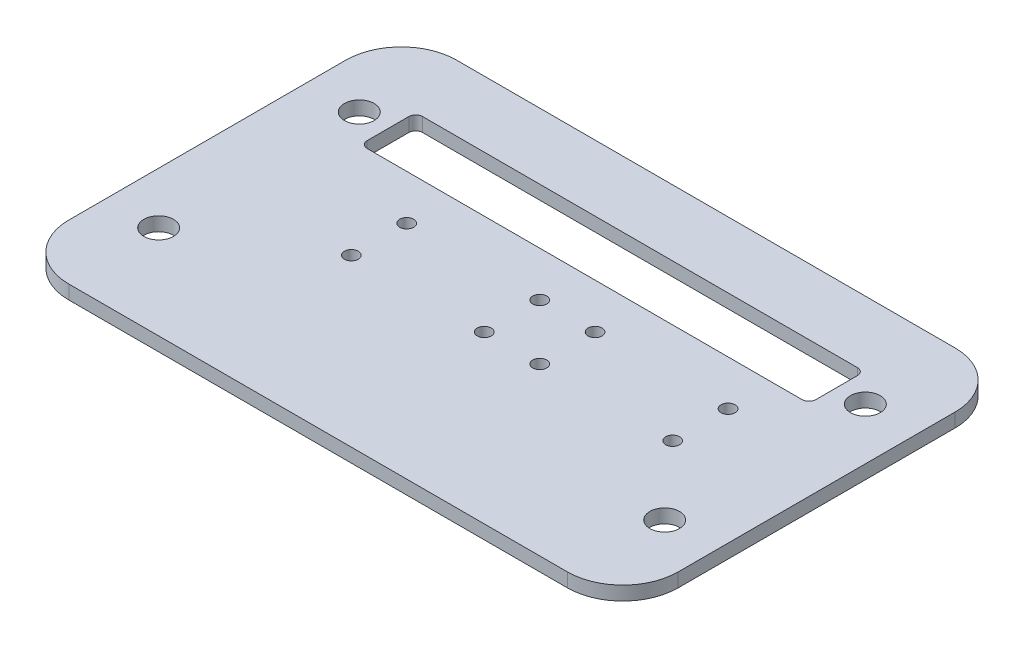
ISO-10303-21;
HEADER;
FILE_DESCRIPTION(('STEP AP214'),'2;1');
FILE_NAME('part.step','',(''),(''),'','','');
FILE_SCHEMA(('AUTOMOTIVE_DESIGN { 1 0 10303 214 1 1 1 1 }'));
ENDSEC;
DATA;
#1=APPLICATION_CONTEXT('core data for automotive mechanical design processes');
#2=APPLICATION_PROTOCOL_DEFINITION('international standard','automotive_design',2000,#1);
#3=PRODUCT_CONTEXT('',#1,'mechanical');
#4=PRODUCT('Part','Part','',(#3));
#5=PRODUCT_RELATED_PRODUCT_CATEGORY('part','',(#4));
#6=PRODUCT_DEFINITION_FORMATION('','',#4);
#7=PRODUCT_DEFINITION_CONTEXT('part definition',#1,'design');
#8=PRODUCT_DEFINITION('design','',#6,#7);
#9=PRODUCT_DEFINITION_SHAPE('','',#8);
#10=(LENGTH_UNIT() NAMED_UNIT(*) SI_UNIT(.MILLI.,.METRE.));
#11=(NAMED_UNIT(*) PLANE_ANGLE_UNIT() SI_UNIT($,.RADIAN.));
#12=(NAMED_UNIT(*) SI_UNIT($,.STERADIAN.) SOLID_ANGLE_UNIT());
#13=UNCERTAINTY_MEASURE_WITH_UNIT(LENGTH_MEASURE(1.E-05),#10,'distance_accuracy_value','');
#14=(GEOMETRIC_REPRESENTATION_CONTEXT(3) GLOBAL_UNCERTAINTY_ASSIGNED_CONTEXT((#13)) GLOBAL_UNIT_ASSIGNED_CONTEXT((#10,
#11,#12)) REPRESENTATION_CONTEXT('',''));
#15=CARTESIAN_POINT('',(0.,0.,0.));
#16=DIRECTION('',(0.,0.,1.));
#17=DIRECTION('',(1.,0.,0.));
#18=AXIS2_PLACEMENT_3D('',#15,#16,#17);
#19=CARTESIAN_POINT('',(34.925,1.5875,22.225));
#20=DIRECTION('',(-1.,0.,0.));
#21=DIRECTION('',(0.,0.,1.));
#22=AXIS2_PLACEMENT_3D('',#19,#20,#21);
#23=PLANE('',#22);
#24=DIRECTION('',(0.,0.,-1.));
#25=VECTOR('',#24,1.);
#26=CARTESIAN_POINT('',(34.925,1.5875,22.225));
#27=LINE('',#26,#25);
#28=CARTESIAN_POINT('',(34.925,1.5875,15.875));
#29=VERTEX_POINT('',#28);
#30=CARTESIAN_POINT('',(34.925,1.5875,-15.875));
#31=VERTEX_POINT('',#30);
#32=EDGE_CURVE('E175',#29,#31,#27,.T.);
#33=ORIENTED_EDGE('',*,*,#32,.F.);
#34=DIRECTION('',(0.,-1.,0.));
#35=VECTOR('',#34,1.);
#36=CARTESIAN_POINT('',(34.925,1.5875,15.875));
#37=LINE('',#36,#35);
#38=CARTESIAN_POINT('',(34.925,0.,15.875));
#39=VERTEX_POINT('',#38);
#40=EDGE_CURVE('E159',#29,#39,#37,.T.);
#41=ORIENTED_EDGE('',*,*,#40,.T.);
#42=DIRECTION('',(0.,0.,-1.));
#43=VECTOR('',#42,1.);
#44=CARTESIAN_POINT('',(34.925,0.,22.225));
#45=LINE('',#44,#43);
#46=CARTESIAN_POINT('',(34.925,0.,-15.875));
#47=VERTEX_POINT('',#46);
#48=EDGE_CURVE('E172',#39,#47,#45,.T.);
#49=ORIENTED_EDGE('',*,*,#48,.T.);
#50=DIRECTION('',(0.,-1.,0.));
#51=VECTOR('',#50,1.);
#52=CARTESIAN_POINT('',(34.925,1.5875,-15.875));
#53=LINE('',#52,#51);
#54=EDGE_CURVE('E178',#47,#31,#53,.F.);
#55=ORIENTED_EDGE('',*,*,#54,.T.);
#56=EDGE_LOOP('',(#33,#41,#49,#55));
#57=FACE_BOUND('',#56,.T.);
#58=ADVANCED_FACE('F41',(#57),#23,.F.);
#59=CARTESIAN_POINT('',(-34.925,1.5875,-22.225));
#60=DIRECTION('',(0.,0.,1.));
#61=DIRECTION('',(1.,0.,0.));
#62=AXIS2_PLACEMENT_3D('',#59,#60,#61);
#63=PLANE('',#62);
#64=DIRECTION('',(-1.,0.,0.));
#65=VECTOR('',#64,1.);
#66=CARTESIAN_POINT('',(-34.925,0.,-22.225));
#67=LINE('',#66,#65);
#68=CARTESIAN_POINT('',(28.575,0.,-22.225));
#69=VERTEX_POINT('',#68);
#70=CARTESIAN_POINT('',(-28.575,0.,-22.225));
#71=VERTEX_POINT('',#70);
#72=EDGE_CURVE('E184',#69,#71,#67,.T.);
#73=ORIENTED_EDGE('',*,*,#72,.T.);
#74=DIRECTION('',(0.,-1.,0.));
#75=VECTOR('',#74,1.);
#76=CARTESIAN_POINT('',(-28.575,1.5875,-22.225));
#77=LINE('',#76,#75);
#78=CARTESIAN_POINT('',(-28.575,1.5875,-22.225));
#79=VERTEX_POINT('',#78);
#80=EDGE_CURVE('E243',#71,#79,#77,.F.);
#81=ORIENTED_EDGE('',*,*,#80,.T.);
#82=DIRECTION('',(-1.,0.,0.));
#83=VECTOR('',#82,1.);
#84=CARTESIAN_POINT('',(-34.925,1.5875,-22.225));
#85=LINE('',#84,#83);
#86=CARTESIAN_POINT('',(28.575,1.5875,-22.225));
#87=VERTEX_POINT('',#86);
#88=EDGE_CURVE('E428',#87,#79,#85,.T.);
#89=ORIENTED_EDGE('',*,*,#88,.F.);
#90=DIRECTION('',(0.,-1.,0.));
#91=VECTOR('',#90,1.);
#92=CARTESIAN_POINT('',(28.575,1.5875,-22.225));
#93=LINE('',#92,#91);
#94=EDGE_CURVE('E239',#87,#69,#93,.T.);
#95=ORIENTED_EDGE('',*,*,#94,.T.);
#96=EDGE_LOOP('',(#73,#81,#89,#95));
#97=FACE_BOUND('',#96,.T.);
#98=ADVANCED_FACE('F454',(#97),#63,.F.);
#99=CARTESIAN_POINT('',(-34.925,1.5875,22.225));
#100=DIRECTION('',(1.,0.,0.));
#101=DIRECTION('',(0.,0.,-1.));
#102=AXIS2_PLACEMENT_3D('',#99,#100,#101);
#103=PLANE('',#102);
#104=DIRECTION('',(0.,0.,1.));
#105=VECTOR('',#104,1.);
#106=CARTESIAN_POINT('',(-34.925,1.5875,22.225));
#107=LINE('',#106,#105);
#108=CARTESIAN_POINT('',(-34.925,1.5875,-15.875));
#109=VERTEX_POINT('',#108);
#110=CARTESIAN_POINT('',(-34.925,1.5875,15.875));
#111=VERTEX_POINT('',#110);
#112=EDGE_CURVE('E430',#109,#111,#107,.T.);
#113=ORIENTED_EDGE('',*,*,#112,.F.);
#114=DIRECTION('',(0.,-1.,0.));
#115=VECTOR('',#114,1.);
#116=CARTESIAN_POINT('',(-34.925,1.5875,-15.875));
#117=LINE('',#116,#115);
#118=CARTESIAN_POINT('',(-34.925,0.,-15.875));
#119=VERTEX_POINT('',#118);
#120=EDGE_CURVE('E235',#109,#119,#117,.T.);
#121=ORIENTED_EDGE('',*,*,#120,.T.);
#122=DIRECTION('',(0.,0.,1.));
#123=VECTOR('',#122,1.);
#124=CARTESIAN_POINT('',(-34.925,0.,22.225));
#125=LINE('',#124,#123);
#126=CARTESIAN_POINT('',(-34.925,0.,15.875));
#127=VERTEX_POINT('',#126);
#128=EDGE_CURVE('E191',#119,#127,#125,.T.);
#129=ORIENTED_EDGE('',*,*,#128,.T.);
#130=DIRECTION('',(0.,-1.,0.));
#131=VECTOR('',#130,1.);
#132=CARTESIAN_POINT('',(-34.925,1.5875,15.875));
#133=LINE('',#132,#131);
#134=EDGE_CURVE('E232',#127,#111,#133,.F.);
#135=ORIENTED_EDGE('',*,*,#134,.T.);
#136=EDGE_LOOP('',(#113,#121,#129,#135));
#137=FACE_BOUND('',#136,.T.);
#138=ADVANCED_FACE('F447',(#137),#103,.F.);
#139=CARTESIAN_POINT('',(-34.925,1.5875,22.225));
#140=DIRECTION('',(0.,0.,-1.));
#141=DIRECTION('',(-1.,0.,0.));
#142=AXIS2_PLACEMENT_3D('',#139,#140,#141);
#143=PLANE('',#142);
#144=DIRECTION('',(1.,0.,0.));
#145=VECTOR('',#144,1.);
#146=CARTESIAN_POINT('',(-34.925,0.,22.225));
#147=LINE('',#146,#145);
#148=CARTESIAN_POINT('',(-28.575,0.,22.225));
#149=VERTEX_POINT('',#148);
#150=CARTESIAN_POINT('',(28.575,0.,22.225));
#151=VERTEX_POINT('',#150);
#152=EDGE_CURVE('E204',#149,#151,#147,.T.);
#153=ORIENTED_EDGE('',*,*,#152,.T.);
#154=DIRECTION('',(0.,-1.,0.));
#155=VECTOR('',#154,1.);
#156=CARTESIAN_POINT('',(28.575,1.5875,22.225));
#157=LINE('',#156,#155);
#158=CARTESIAN_POINT('',(28.575,1.5875,22.225));
#159=VERTEX_POINT('',#158);
#160=EDGE_CURVE('E160',#151,#159,#157,.F.);
#161=ORIENTED_EDGE('',*,*,#160,.T.);
#162=DIRECTION('',(1.,0.,0.));
#163=VECTOR('',#162,1.);
#164=CARTESIAN_POINT('',(-34.925,1.5875,22.225));
#165=LINE('',#164,#163);
#166=CARTESIAN_POINT('',(-28.575,1.5875,22.225));
#167=VERTEX_POINT('',#166);
#168=EDGE_CURVE('E198',#167,#159,#165,.T.);
#169=ORIENTED_EDGE('',*,*,#168,.F.);
#170=DIRECTION('',(0.,-1.,0.));
#171=VECTOR('',#170,1.);
#172=CARTESIAN_POINT('',(-28.575,1.5875,22.225));
#173=LINE('',#172,#171);
#174=EDGE_CURVE('E166',#167,#149,#173,.T.);
#175=ORIENTED_EDGE('',*,*,#174,.T.);
#176=EDGE_LOOP('',(#153,#161,#169,#175));
#177=FACE_BOUND('',#176,.T.);
#178=ADVANCED_FACE('F441',(#177),#143,.F.);
#179=CARTESIAN_POINT('',(0.,1.5875,0.));
#180=DIRECTION('',(0.,-1.,0.));
#181=DIRECTION('',(0.,0.,-1.));
#182=AXIS2_PLACEMENT_3D('',#179,#180,#181);
#183=PLANE('',#182);
#184=DIRECTION('',(1.,0.,0.));
#185=VECTOR('',#184,1.);
#186=CARTESIAN_POINT('',(-25.7125,1.5875,-8.325));
#187=LINE('',#186,#185);
#188=CARTESIAN_POINT('',(-24.91875,1.5875,-8.325));
#189=VERTEX_POINT('',#188);
#190=CARTESIAN_POINT('',(24.91875,1.5875,-8.325));
#191=VERTEX_POINT('',#190);
#192=EDGE_CURVE('E331',#189,#191,#187,.T.);
#193=ORIENTED_EDGE('',*,*,#192,.F.);
#194=CARTESIAN_POINT('',(-24.91875,1.5875,-9.11875));
#195=DIRECTION('',(0.,-1.,0.));
#196=DIRECTION('',(0.,0.,-1.));
#197=AXIS2_PLACEMENT_3D('',#194,#195,#196);
#198=CIRCLE('',#197,0.79375);
#199=CARTESIAN_POINT('',(-25.7125,1.5875,-9.11875));
#200=VERTEX_POINT('',#199);
#201=EDGE_CURVE('E284',#189,#200,#198,.T.);
#202=ORIENTED_EDGE('',*,*,#201,.T.);
#203=DIRECTION('',(0.,0.,1.));
#204=VECTOR('',#203,1.);
#205=CARTESIAN_POINT('',(-25.7125,1.5875,-14.675));
#206=LINE('',#205,#204);
#207=CARTESIAN_POINT('',(-25.7125,1.5875,-13.88125));
#208=VERTEX_POINT('',#207);
#209=EDGE_CURVE('E298',#208,#200,#206,.T.);
#210=ORIENTED_EDGE('',*,*,#209,.F.);
#211=CARTESIAN_POINT('',(-24.91875,1.5875,-13.88125));
#212=DIRECTION('',(0.,-1.,0.));
#213=DIRECTION('',(0.,0.,-1.));
#214=AXIS2_PLACEMENT_3D('',#211,#212,#213);
#215=CIRCLE('',#214,0.79375);
#216=CARTESIAN_POINT('',(-24.91875,1.5875,-14.675));
#217=VERTEX_POINT('',#216);
#218=EDGE_CURVE('E50',#208,#217,#215,.T.);
#219=ORIENTED_EDGE('',*,*,#218,.T.);
#220=DIRECTION('',(-1.,0.,0.));
#221=VECTOR('',#220,1.);
#222=CARTESIAN_POINT('',(-25.7125,1.5875,-14.675));
#223=LINE('',#222,#221);
#224=CARTESIAN_POINT('',(24.91875,1.5875,-14.675));
#225=VERTEX_POINT('',#224);
#226=EDGE_CURVE('E297',#225,#217,#223,.T.);
#227=ORIENTED_EDGE('',*,*,#226,.F.);
#228=CARTESIAN_POINT('',(24.91875,1.5875,-13.88125));
#229=DIRECTION('',(0.,-1.,0.));
#230=DIRECTION('',(0.,0.,-1.));
#231=AXIS2_PLACEMENT_3D('',#228,#229,#230);
#232=CIRCLE('',#231,0.79375);
#233=CARTESIAN_POINT('',(25.7125,1.5875,-13.88125));
#234=VERTEX_POINT('',#233);
#235=EDGE_CURVE('E272',#225,#234,#232,.T.);
#236=ORIENTED_EDGE('',*,*,#235,.T.);
#237=DIRECTION('',(0.,0.,-1.));
#238=VECTOR('',#237,1.);
#239=CARTESIAN_POINT('',(25.7125,1.5875,-14.675));
#240=LINE('',#239,#238);
#241=CARTESIAN_POINT('',(25.7125,1.5875,-9.11875));
#242=VERTEX_POINT('',#241);
#243=EDGE_CURVE('E308',#242,#234,#240,.T.);
#244=ORIENTED_EDGE('',*,*,#243,.F.);
#245=CARTESIAN_POINT('',(24.91875,1.5875,-9.11875));
#246=DIRECTION('',(0.,-1.,0.));
#247=DIRECTION('',(0.,0.,-1.));
#248=AXIS2_PLACEMENT_3D('',#245,#246,#247);
#249=CIRCLE('',#248,0.79375);
#250=EDGE_CURVE('E278',#242,#191,#249,.T.);
#251=ORIENTED_EDGE('',*,*,#250,.T.);
#252=EDGE_LOOP('',(#193,#202,#210,#219,#227,#236,#244,#251));
#253=FACE_BOUND('',#252,.T.);
#254=CARTESIAN_POINT('',(-15.24,1.5875,-3.175));
#255=DIRECTION('',(0.,1.,0.));
#256=DIRECTION('',(0.,0.,1.));
#257=AXIS2_PLACEMENT_3D('',#254,#255,#256);
#258=CIRCLE('',#257,0.8);
#259=CARTESIAN_POINT('',(-15.24,1.5875,-2.375));
#260=VERTEX_POINT('',#259);
#261=EDGE_CURVE('E328',#260,#260,#258,.T.);
#262=ORIENTED_EDGE('',*,*,#261,.F.);
#263=EDGE_LOOP('',(#262));
#264=FACE_BOUND('',#263,.T.);
#265=CARTESIAN_POINT('',(0.,1.5875,-3.175));
#266=DIRECTION('',(0.,1.,0.));
#267=DIRECTION('',(0.,0.,1.));
#268=AXIS2_PLACEMENT_3D('',#265,#266,#267);
#269=CIRCLE('',#268,0.799999999999999);
#270=CARTESIAN_POINT('',(0.,1.5875,-2.375));
#271=VERTEX_POINT('',#270);
#272=EDGE_CURVE('E344',#271,#271,#269,.T.);
#273=ORIENTED_EDGE('',*,*,#272,.F.);
#274=EDGE_LOOP('',(#273));
#275=FACE_BOUND('',#274,.T.);
#276=CARTESIAN_POINT('',(-15.24,1.5875,3.175));
#277=DIRECTION('',(0.,1.,0.));
#278=DIRECTION('',(0.,0.,1.));
#279=AXIS2_PLACEMENT_3D('',#276,#277,#278);
#280=CIRCLE('',#279,0.8);
#281=CARTESIAN_POINT('',(-15.24,1.5875,3.975));
#282=VERTEX_POINT('',#281);
#283=EDGE_CURVE('E351',#282,#282,#280,.T.);
#284=ORIENTED_EDGE('',*,*,#283,.F.);
#285=EDGE_LOOP('',(#284));
#286=FACE_BOUND('',#285,.T.);
#287=CARTESIAN_POINT('',(0.,1.5875,3.175));
#288=DIRECTION('',(0.,1.,0.));
#289=DIRECTION('',(0.,0.,1.));
#290=AXIS2_PLACEMENT_3D('',#287,#288,#289);
#291=CIRCLE('',#290,0.799999999999999);
#292=CARTESIAN_POINT('',(0.,1.5875,3.975));
#293=VERTEX_POINT('',#292);
#294=EDGE_CURVE('E359',#293,#293,#291,.T.);
#295=ORIENTED_EDGE('',*,*,#294,.F.);
#296=EDGE_LOOP('',(#295));
#297=FACE_BOUND('',#296,.T.);
#298=CARTESIAN_POINT('',(6.35,1.5875,-3.175));
#299=DIRECTION('',(0.,1.,0.));
#300=DIRECTION('',(0.,0.,1.));
#301=AXIS2_PLACEMENT_3D('',#298,#299,#300);
#302=CIRCLE('',#301,0.799999999999999);
#303=CARTESIAN_POINT('',(6.35,1.5875,-2.375));
#304=VERTEX_POINT('',#303);
#305=EDGE_CURVE('E367',#304,#304,#302,.T.);
#306=ORIENTED_EDGE('',*,*,#305,.F.);
#307=EDGE_LOOP('',(#306));
#308=FACE_BOUND('',#307,.T.);
#309=CARTESIAN_POINT('',(21.59,1.5875,-3.175));
#310=DIRECTION('',(0.,1.,0.));
#311=DIRECTION('',(0.,0.,1.));
#312=AXIS2_PLACEMENT_3D('',#309,#310,#311);
#313=CIRCLE('',#312,0.799999999999999);
#314=CARTESIAN_POINT('',(21.59,1.5875,-2.375));
#315=VERTEX_POINT('',#314);
#316=EDGE_CURVE('E375',#315,#315,#313,.T.);
#317=ORIENTED_EDGE('',*,*,#316,.F.);
#318=EDGE_LOOP('',(#317));
#319=FACE_BOUND('',#318,.T.);
#320=CARTESIAN_POINT('',(6.35,1.5875,3.175));
#321=DIRECTION('',(0.,1.,0.));
#322=DIRECTION('',(0.,0.,1.));
#323=AXIS2_PLACEMENT_3D('',#320,#321,#322);
#324=CIRCLE('',#323,0.799999999999999);
#325=CARTESIAN_POINT('',(6.35,1.5875,3.975));
#326=VERTEX_POINT('',#325);
#327=EDGE_CURVE('E383',#326,#326,#324,.T.);
#328=ORIENTED_EDGE('',*,*,#327,.F.);
#329=EDGE_LOOP('',(#328));
#330=FACE_BOUND('',#329,.T.);
#331=CARTESIAN_POINT('',(21.59,1.5875,3.175));
#332=DIRECTION('',(0.,1.,0.));
#333=DIRECTION('',(0.,0.,1.));
#334=AXIS2_PLACEMENT_3D('',#331,#332,#333);
#335=CIRCLE('',#334,0.799999999999999);
#336=CARTESIAN_POINT('',(21.59,1.5875,3.975));
#337=VERTEX_POINT('',#336);
#338=EDGE_CURVE('E391',#337,#337,#335,.T.);
#339=ORIENTED_EDGE('',*,*,#338,.F.);
#340=EDGE_LOOP('',(#339));
#341=FACE_BOUND('',#340,.T.);
#342=CARTESIAN_POINT('',(-29.,1.5875,-11.5));
#343=DIRECTION('',(0.,1.,0.));
#344=DIRECTION('',(0.,0.,1.));
#345=AXIS2_PLACEMENT_3D('',#342,#343,#344);
#346=CIRCLE('',#345,1.69999999999999);
#347=CARTESIAN_POINT('',(-29.,1.5875,-9.80000000000001));
#348=VERTEX_POINT('',#347);
#349=EDGE_CURVE('E399',#348,#348,#346,.T.);
#350=ORIENTED_EDGE('',*,*,#349,.F.);
#351=EDGE_LOOP('',(#350));
#352=FACE_BOUND('',#351,.T.);
#353=CARTESIAN_POINT('',(-29.,1.5875,11.5));
#354=DIRECTION('',(0.,1.,0.));
#355=DIRECTION('',(0.,0.,1.));
#356=AXIS2_PLACEMENT_3D('',#353,#354,#355);
#357=CIRCLE('',#356,1.69999999999999);
#358=CARTESIAN_POINT('',(-29.,1.5875,13.2));
#359=VERTEX_POINT('',#358);
#360=EDGE_CURVE('E407',#359,#359,#357,.T.);
#361=ORIENTED_EDGE('',*,*,#360,.F.);
#362=EDGE_LOOP('',(#361));
#363=FACE_BOUND('',#362,.T.);
#364=CARTESIAN_POINT('',(29.,1.5875,11.5));
#365=DIRECTION('',(0.,1.,0.));
#366=DIRECTION('',(0.,0.,1.));
#367=AXIS2_PLACEMENT_3D('',#364,#365,#366);
#368=CIRCLE('',#367,1.69999999999999);
#369=CARTESIAN_POINT('',(29.,1.5875,13.2));
#370=VERTEX_POINT('',#369);
#371=EDGE_CURVE('E415',#370,#370,#368,.T.);
#372=ORIENTED_EDGE('',*,*,#371,.F.);
#373=EDGE_LOOP('',(#372));
#374=FACE_BOUND('',#373,.T.);
#375=CARTESIAN_POINT('',(29.,1.5875,-11.5));
#376=DIRECTION('',(0.,1.,0.));
#377=DIRECTION('',(0.,0.,1.));
#378=AXIS2_PLACEMENT_3D('',#375,#376,#377);
#379=CIRCLE('',#378,1.69999999999999);
#380=CARTESIAN_POINT('',(29.,1.5875,-9.80000000000001));
#381=VERTEX_POINT('',#380);
#382=EDGE_CURVE('E195',#381,#381,#379,.T.);
#383=ORIENTED_EDGE('',*,*,#382,.F.);
#384=EDGE_LOOP('',(#383));
#385=FACE_BOUND('',#384,.T.);
#386=ORIENTED_EDGE('',*,*,#168,.T.);
#387=CARTESIAN_POINT('',(28.575,1.5875,15.875));
#388=DIRECTION('',(0.,-1.,0.));
#389=DIRECTION('',(0.,0.,-1.));
#390=AXIS2_PLACEMENT_3D('',#387,#388,#389);
#391=CIRCLE('',#390,6.35);
#392=EDGE_CURVE('E229',#159,#29,#391,.F.);
#393=ORIENTED_EDGE('',*,*,#392,.T.);
#394=ORIENTED_EDGE('',*,*,#32,.T.);
#395=CARTESIAN_POINT('',(28.575,1.5875,-15.875));
#396=DIRECTION('',(0.,-1.,0.));
#397=DIRECTION('',(0.,0.,-1.));
#398=AXIS2_PLACEMENT_3D('',#395,#396,#397);
#399=CIRCLE('',#398,6.35);
#400=EDGE_CURVE('E223',#31,#87,#399,.F.);
#401=ORIENTED_EDGE('',*,*,#400,.T.);
#402=ORIENTED_EDGE('',*,*,#88,.T.);
#403=CARTESIAN_POINT('',(-28.575,1.5875,-15.875));
#404=DIRECTION('',(0.,-1.,0.));
#405=DIRECTION('',(0.,0.,-1.));
#406=AXIS2_PLACEMENT_3D('',#403,#404,#405);
#407=CIRCLE('',#406,6.35);
#408=EDGE_CURVE('E226',#79,#109,#407,.F.);
#409=ORIENTED_EDGE('',*,*,#408,.T.);
#410=ORIENTED_EDGE('',*,*,#112,.T.);
#411=CARTESIAN_POINT('',(-28.575,1.5875,15.875));
#412=DIRECTION('',(0.,-1.,0.));
#413=DIRECTION('',(0.,0.,-1.));
#414=AXIS2_PLACEMENT_3D('',#411,#412,#413);
#415=CIRCLE('',#414,6.35);
#416=EDGE_CURVE('E220',#111,#167,#415,.F.);
#417=ORIENTED_EDGE('',*,*,#416,.T.);
#418=EDGE_LOOP('',(#386,#393,#394,#401,#402,#409,#410,#417));
#419=FACE_BOUND('',#418,.T.);
#420=ADVANCED_FACE('F295',(#253,#264,#275,#286,#297,#308,#319,#330,#341,#352,#363,#374,#385,
#419),#183,.F.);
#421=CARTESIAN_POINT('',(0.,0.,0.));
#422=DIRECTION('',(0.,-1.,0.));
#423=DIRECTION('',(0.,0.,-1.));
#424=AXIS2_PLACEMENT_3D('',#421,#422,#423);
#425=PLANE('',#424);
#426=DIRECTION('',(-1.,0.,0.));
#427=VECTOR('',#426,1.);
#428=CARTESIAN_POINT('',(-25.7125,0.,-14.675));
#429=LINE('',#428,#427);
#430=CARTESIAN_POINT('',(24.91875,0.,-14.675));
#431=VERTEX_POINT('',#430);
#432=CARTESIAN_POINT('',(-24.91875,0.,-14.675));
#433=VERTEX_POINT('',#432);
#434=EDGE_CURVE('E325',#431,#433,#429,.T.);
#435=ORIENTED_EDGE('',*,*,#434,.T.);
#436=CARTESIAN_POINT('',(-24.91875,0.,-13.88125));
#437=DIRECTION('',(0.,-1.,0.));
#438=DIRECTION('',(0.,0.,-1.));
#439=AXIS2_PLACEMENT_3D('',#436,#437,#438);
#440=CIRCLE('',#439,0.79375);
#441=CARTESIAN_POINT('',(-25.7125,0.,-13.88125));
#442=VERTEX_POINT('',#441);
#443=EDGE_CURVE('E11',#433,#442,#440,.F.);
#444=ORIENTED_EDGE('',*,*,#443,.T.);
#445=DIRECTION('',(0.,0.,1.));
#446=VECTOR('',#445,1.);
#447=CARTESIAN_POINT('',(-25.7125,0.,-14.675));
#448=LINE('',#447,#446);
#449=CARTESIAN_POINT('',(-25.7125,0.,-9.11875));
#450=VERTEX_POINT('',#449);
#451=EDGE_CURVE('E307',#442,#450,#448,.T.);
#452=ORIENTED_EDGE('',*,*,#451,.T.);
#453=CARTESIAN_POINT('',(-24.91875,0.,-9.11875));
#454=DIRECTION('',(0.,-1.,0.));
#455=DIRECTION('',(0.,0.,-1.));
#456=AXIS2_PLACEMENT_3D('',#453,#454,#455);
#457=CIRCLE('',#456,0.79375);
#458=CARTESIAN_POINT('',(-24.91875,0.,-8.325));
#459=VERTEX_POINT('',#458);
#460=EDGE_CURVE('E287',#450,#459,#457,.F.);
#461=ORIENTED_EDGE('',*,*,#460,.T.);
#462=DIRECTION('',(1.,0.,0.));
#463=VECTOR('',#462,1.);
#464=CARTESIAN_POINT('',(-25.7125,0.,-8.325));
#465=LINE('',#464,#463);
#466=CARTESIAN_POINT('',(24.91875,0.,-8.325));
#467=VERTEX_POINT('',#466);
#468=EDGE_CURVE('E313',#459,#467,#465,.T.);
#469=ORIENTED_EDGE('',*,*,#468,.T.);
#470=CARTESIAN_POINT('',(24.91875,0.,-9.11875));
#471=DIRECTION('',(0.,-1.,0.));
#472=DIRECTION('',(0.,0.,-1.));
#473=AXIS2_PLACEMENT_3D('',#470,#471,#472);
#474=CIRCLE('',#473,0.79375);
#475=CARTESIAN_POINT('',(25.7125,0.,-9.11875));
#476=VERTEX_POINT('',#475);
#477=EDGE_CURVE('E281',#467,#476,#474,.F.);
#478=ORIENTED_EDGE('',*,*,#477,.T.);
#479=DIRECTION('',(0.,0.,-1.));
#480=VECTOR('',#479,1.);
#481=CARTESIAN_POINT('',(25.7125,0.,-14.675));
#482=LINE('',#481,#480);
#483=CARTESIAN_POINT('',(25.7125,0.,-13.88125));
#484=VERTEX_POINT('',#483);
#485=EDGE_CURVE('E319',#476,#484,#482,.T.);
#486=ORIENTED_EDGE('',*,*,#485,.T.);
#487=CARTESIAN_POINT('',(24.91875,0.,-13.88125));
#488=DIRECTION('',(0.,-1.,0.));
#489=DIRECTION('',(0.,0.,-1.));
#490=AXIS2_PLACEMENT_3D('',#487,#488,#489);
#491=CIRCLE('',#490,0.79375);
#492=EDGE_CURVE('E275',#484,#431,#491,.F.);
#493=ORIENTED_EDGE('',*,*,#492,.T.);
#494=EDGE_LOOP('',(#435,#444,#452,#461,#469,#478,#486,#493));
#495=FACE_BOUND('',#494,.T.);
#496=CARTESIAN_POINT('',(-15.24,0.,-3.175));
#497=DIRECTION('',(0.,1.,0.));
#498=DIRECTION('',(0.,0.,1.));
#499=AXIS2_PLACEMENT_3D('',#496,#497,#498);
#500=CIRCLE('',#499,0.799999999999999);
#501=CARTESIAN_POINT('',(-15.24,0.,-2.375));
#502=VERTEX_POINT('',#501);
#503=EDGE_CURVE('E340',#502,#502,#500,.T.);
#504=ORIENTED_EDGE('',*,*,#503,.T.);
#505=EDGE_LOOP('',(#504));
#506=FACE_BOUND('',#505,.T.);
#507=CARTESIAN_POINT('',(0.,0.,-3.175));
#508=DIRECTION('',(0.,1.,0.));
#509=DIRECTION('',(0.,0.,1.));
#510=AXIS2_PLACEMENT_3D('',#507,#508,#509);
#511=CIRCLE('',#510,0.799999999999999);
#512=CARTESIAN_POINT('',(0.,0.,-2.375));
#513=VERTEX_POINT('',#512);
#514=EDGE_CURVE('E347',#513,#513,#511,.T.);
#515=ORIENTED_EDGE('',*,*,#514,.T.);
#516=EDGE_LOOP('',(#515));
#517=FACE_BOUND('',#516,.T.);
#518=CARTESIAN_POINT('',(-15.24,0.,3.175));
#519=DIRECTION('',(0.,1.,0.));
#520=DIRECTION('',(0.,0.,1.));
#521=AXIS2_PLACEMENT_3D('',#518,#519,#520);
#522=CIRCLE('',#521,0.799999999999999);
#523=CARTESIAN_POINT('',(-15.24,0.,3.975));
#524=VERTEX_POINT('',#523);
#525=EDGE_CURVE('E355',#524,#524,#522,.T.);
#526=ORIENTED_EDGE('',*,*,#525,.T.);
#527=EDGE_LOOP('',(#526));
#528=FACE_BOUND('',#527,.T.);
#529=CARTESIAN_POINT('',(0.,0.,3.175));
#530=DIRECTION('',(0.,1.,0.));
#531=DIRECTION('',(0.,0.,1.));
#532=AXIS2_PLACEMENT_3D('',#529,#530,#531);
#533=CIRCLE('',#532,0.799999999999999);
#534=CARTESIAN_POINT('',(0.,0.,3.975));
#535=VERTEX_POINT('',#534);
#536=EDGE_CURVE('E363',#535,#535,#533,.T.);
#537=ORIENTED_EDGE('',*,*,#536,.T.);
#538=EDGE_LOOP('',(#537));
#539=FACE_BOUND('',#538,.T.);
#540=CARTESIAN_POINT('',(6.35,0.,-3.175));
#541=DIRECTION('',(0.,1.,0.));
#542=DIRECTION('',(0.,0.,1.));
#543=AXIS2_PLACEMENT_3D('',#540,#541,#542);
#544=CIRCLE('',#543,0.799999999999999);
#545=CARTESIAN_POINT('',(6.35,0.,-2.375));
#546=VERTEX_POINT('',#545);
#547=EDGE_CURVE('E371',#546,#546,#544,.T.);
#548=ORIENTED_EDGE('',*,*,#547,.T.);
#549=EDGE_LOOP('',(#548));
#550=FACE_BOUND('',#549,.T.);
#551=CARTESIAN_POINT('',(21.59,0.,-3.175));
#552=DIRECTION('',(0.,1.,0.));
#553=DIRECTION('',(0.,0.,1.));
#554=AXIS2_PLACEMENT_3D('',#551,#552,#553);
#555=CIRCLE('',#554,0.799999999999999);
#556=CARTESIAN_POINT('',(21.59,0.,-2.375));
#557=VERTEX_POINT('',#556);
#558=EDGE_CURVE('E379',#557,#557,#555,.T.);
#559=ORIENTED_EDGE('',*,*,#558,.T.);
#560=EDGE_LOOP('',(#559));
#561=FACE_BOUND('',#560,.T.);
#562=CARTESIAN_POINT('',(6.35,0.,3.175));
#563=DIRECTION('',(0.,1.,0.));
#564=DIRECTION('',(0.,0.,1.));
#565=AXIS2_PLACEMENT_3D('',#562,#563,#564);
#566=CIRCLE('',#565,0.799999999999999);
#567=CARTESIAN_POINT('',(6.35,0.,3.975));
#568=VERTEX_POINT('',#567);
#569=EDGE_CURVE('E387',#568,#568,#566,.T.);
#570=ORIENTED_EDGE('',*,*,#569,.T.);
#571=EDGE_LOOP('',(#570));
#572=FACE_BOUND('',#571,.T.);
#573=CARTESIAN_POINT('',(21.59,0.,3.175));
#574=DIRECTION('',(0.,1.,0.));
#575=DIRECTION('',(0.,0.,1.));
#576=AXIS2_PLACEMENT_3D('',#573,#574,#575);
#577=CIRCLE('',#576,0.799999999999999);
#578=CARTESIAN_POINT('',(21.59,0.,3.975));
#579=VERTEX_POINT('',#578);
#580=EDGE_CURVE('E395',#579,#579,#577,.T.);
#581=ORIENTED_EDGE('',*,*,#580,.T.);
#582=EDGE_LOOP('',(#581));
#583=FACE_BOUND('',#582,.T.);
#584=CARTESIAN_POINT('',(-29.,0.,-11.5));
#585=DIRECTION('',(0.,1.,0.));
#586=DIRECTION('',(0.,0.,1.));
#587=AXIS2_PLACEMENT_3D('',#584,#585,#586);
#588=CIRCLE('',#587,1.7);
#589=CARTESIAN_POINT('',(-29.,0.,-9.8));
#590=VERTEX_POINT('',#589);
#591=EDGE_CURVE('E403',#590,#590,#588,.T.);
#592=ORIENTED_EDGE('',*,*,#591,.T.);
#593=EDGE_LOOP('',(#592));
#594=FACE_BOUND('',#593,.T.);
#595=CARTESIAN_POINT('',(-29.,0.,11.5));
#596=DIRECTION('',(0.,1.,0.));
#597=DIRECTION('',(0.,0.,1.));
#598=AXIS2_PLACEMENT_3D('',#595,#596,#597);
#599=CIRCLE('',#598,1.7);
#600=CARTESIAN_POINT('',(-29.,0.,13.2));
#601=VERTEX_POINT('',#600);
#602=EDGE_CURVE('E411',#601,#601,#599,.T.);
#603=ORIENTED_EDGE('',*,*,#602,.T.);
#604=EDGE_LOOP('',(#603));
#605=FACE_BOUND('',#604,.T.);
#606=CARTESIAN_POINT('',(29.,0.,11.5));
#607=DIRECTION('',(0.,1.,0.));
#608=DIRECTION('',(0.,0.,1.));
#609=AXIS2_PLACEMENT_3D('',#606,#607,#608);
#610=CIRCLE('',#609,1.7);
#611=CARTESIAN_POINT('',(29.,0.,13.2));
#612=VERTEX_POINT('',#611);
#613=EDGE_CURVE('E419',#612,#612,#610,.T.);
#614=ORIENTED_EDGE('',*,*,#613,.T.);
#615=EDGE_LOOP('',(#614));
#616=FACE_BOUND('',#615,.T.);
#617=CARTESIAN_POINT('',(29.,0.,-11.5));
#618=DIRECTION('',(0.,1.,0.));
#619=DIRECTION('',(0.,0.,1.));
#620=AXIS2_PLACEMENT_3D('',#617,#618,#619);
#621=CIRCLE('',#620,1.7);
#622=CARTESIAN_POINT('',(29.,0.,-9.8));
#623=VERTEX_POINT('',#622);
#624=EDGE_CURVE('E185',#623,#623,#621,.T.);
#625=ORIENTED_EDGE('',*,*,#624,.T.);
#626=EDGE_LOOP('',(#625));
#627=FACE_BOUND('',#626,.T.);
#628=ORIENTED_EDGE('',*,*,#48,.F.);
#629=CARTESIAN_POINT('',(28.575,0.,15.875));
#630=DIRECTION('',(0.,-1.,0.));
#631=DIRECTION('',(0.,0.,-1.));
#632=AXIS2_PLACEMENT_3D('',#629,#630,#631);
#633=CIRCLE('',#632,6.35);
#634=EDGE_CURVE('E155',#39,#151,#633,.T.);
#635=ORIENTED_EDGE('',*,*,#634,.T.);
#636=ORIENTED_EDGE('',*,*,#152,.F.);
#637=CARTESIAN_POINT('',(-28.575,0.,15.875));
#638=DIRECTION('',(0.,-1.,0.));
#639=DIRECTION('',(0.,0.,-1.));
#640=AXIS2_PLACEMENT_3D('',#637,#638,#639);
#641=CIRCLE('',#640,6.35);
#642=EDGE_CURVE('E177',#149,#127,#641,.T.);
#643=ORIENTED_EDGE('',*,*,#642,.T.);
#644=ORIENTED_EDGE('',*,*,#128,.F.);
#645=CARTESIAN_POINT('',(-28.575,0.,-15.875));
#646=DIRECTION('',(0.,-1.,0.));
#647=DIRECTION('',(0.,0.,-1.));
#648=AXIS2_PLACEMENT_3D('',#645,#646,#647);
#649=CIRCLE('',#648,6.35);
#650=EDGE_CURVE('E167',#119,#71,#649,.T.);
#651=ORIENTED_EDGE('',*,*,#650,.T.);
#652=ORIENTED_EDGE('',*,*,#72,.F.);
#653=CARTESIAN_POINT('',(28.575,0.,-15.875));
#654=DIRECTION('',(0.,-1.,0.));
#655=DIRECTION('',(0.,0.,-1.));
#656=AXIS2_PLACEMENT_3D('',#653,#654,#655);
#657=CIRCLE('',#656,6.35);
#658=EDGE_CURVE('E182',#69,#47,#657,.T.);
#659=ORIENTED_EDGE('',*,*,#658,.T.);
#660=EDGE_LOOP('',(#628,#635,#636,#643,#644,#651,#652,#659));
#661=FACE_BOUND('',#660,.T.);
#662=ADVANCED_FACE('F180',(#495,#506,#517,#528,#539,#550,#561,#572,#583,#594,#605,#616,#627,
#661),#425,.T.);
#663=CARTESIAN_POINT('',(29.,1.5875,-11.5));
#664=DIRECTION('',(0.,1.,0.));
#665=DIRECTION('',(0.,0.,1.));
#666=AXIS2_PLACEMENT_3D('',#663,#664,#665);
#667=CYLINDRICAL_SURFACE('',#666,1.69999999999999);
#668=ORIENTED_EDGE('',*,*,#624,.F.);
#669=EDGE_LOOP('',(#668));
#670=FACE_BOUND('',#669,.T.);
#671=ORIENTED_EDGE('',*,*,#382,.T.);
#672=EDGE_LOOP('',(#671));
#673=FACE_BOUND('',#672,.T.);
#674=ADVANCED_FACE('F529',(#670,#673),#667,.F.);
#675=CARTESIAN_POINT('',(29.,1.5875,11.5));
#676=DIRECTION('',(0.,1.,0.));
#677=DIRECTION('',(0.,0.,1.));
#678=AXIS2_PLACEMENT_3D('',#675,#676,#677);
#679=CYLINDRICAL_SURFACE('',#678,1.69999999999999);
#680=ORIENTED_EDGE('',*,*,#613,.F.);
#681=EDGE_LOOP('',(#680));
#682=FACE_BOUND('',#681,.T.);
#683=ORIENTED_EDGE('',*,*,#371,.T.);
#684=EDGE_LOOP('',(#683));
#685=FACE_BOUND('',#684,.T.);
#686=ADVANCED_FACE('F525',(#682,#685),#679,.F.);
#687=CARTESIAN_POINT('',(-29.,1.5875,11.5));
#688=DIRECTION('',(0.,1.,0.));
#689=DIRECTION('',(0.,0.,1.));
#690=AXIS2_PLACEMENT_3D('',#687,#688,#689);
#691=CYLINDRICAL_SURFACE('',#690,1.69999999999999);
#692=ORIENTED_EDGE('',*,*,#602,.F.);
#693=EDGE_LOOP('',(#692));
#694=FACE_BOUND('',#693,.T.);
#695=ORIENTED_EDGE('',*,*,#360,.T.);
#696=EDGE_LOOP('',(#695));
#697=FACE_BOUND('',#696,.T.);
#698=ADVANCED_FACE('F521',(#694,#697),#691,.F.);
#699=CARTESIAN_POINT('',(-29.,1.5875,-11.5));
#700=DIRECTION('',(0.,1.,0.));
#701=DIRECTION('',(0.,0.,1.));
#702=AXIS2_PLACEMENT_3D('',#699,#700,#701);
#703=CYLINDRICAL_SURFACE('',#702,1.69999999999999);
#704=ORIENTED_EDGE('',*,*,#591,.F.);
#705=EDGE_LOOP('',(#704));
#706=FACE_BOUND('',#705,.T.);
#707=ORIENTED_EDGE('',*,*,#349,.T.);
#708=EDGE_LOOP('',(#707));
#709=FACE_BOUND('',#708,.T.);
#710=ADVANCED_FACE('F517',(#706,#709),#703,.F.);
#711=CARTESIAN_POINT('',(21.59,1.5875,3.175));
#712=DIRECTION('',(0.,1.,0.));
#713=DIRECTION('',(0.,0.,1.));
#714=AXIS2_PLACEMENT_3D('',#711,#712,#713);
#715=CYLINDRICAL_SURFACE('',#714,0.799999999999999);
#716=ORIENTED_EDGE('',*,*,#580,.F.);
#717=EDGE_LOOP('',(#716));
#718=FACE_BOUND('',#717,.T.);
#719=ORIENTED_EDGE('',*,*,#338,.T.);
#720=EDGE_LOOP('',(#719));
#721=FACE_BOUND('',#720,.T.);
#722=ADVANCED_FACE('F513',(#718,#721),#715,.F.);
#723=CARTESIAN_POINT('',(6.35,1.5875,3.175));
#724=DIRECTION('',(0.,1.,0.));
#725=DIRECTION('',(0.,0.,1.));
#726=AXIS2_PLACEMENT_3D('',#723,#724,#725);
#727=CYLINDRICAL_SURFACE('',#726,0.799999999999999);
#728=ORIENTED_EDGE('',*,*,#569,.F.);
#729=EDGE_LOOP('',(#728));
#730=FACE_BOUND('',#729,.T.);
#731=ORIENTED_EDGE('',*,*,#327,.T.);
#732=EDGE_LOOP('',(#731));
#733=FACE_BOUND('',#732,.T.);
#734=ADVANCED_FACE('F509',(#730,#733),#727,.F.);
#735=CARTESIAN_POINT('',(21.59,1.5875,-3.175));
#736=DIRECTION('',(0.,1.,0.));
#737=DIRECTION('',(0.,0.,1.));
#738=AXIS2_PLACEMENT_3D('',#735,#736,#737);
#739=CYLINDRICAL_SURFACE('',#738,0.799999999999999);
#740=ORIENTED_EDGE('',*,*,#558,.F.);
#741=EDGE_LOOP('',(#740));
#742=FACE_BOUND('',#741,.T.);
#743=ORIENTED_EDGE('',*,*,#316,.T.);
#744=EDGE_LOOP('',(#743));
#745=FACE_BOUND('',#744,.T.);
#746=ADVANCED_FACE('F505',(#742,#745),#739,.F.);
#747=CARTESIAN_POINT('',(6.35,1.5875,-3.175));
#748=DIRECTION('',(0.,1.,0.));
#749=DIRECTION('',(0.,0.,1.));
#750=AXIS2_PLACEMENT_3D('',#747,#748,#749);
#751=CYLINDRICAL_SURFACE('',#750,0.799999999999999);
#752=ORIENTED_EDGE('',*,*,#547,.F.);
#753=EDGE_LOOP('',(#752));
#754=FACE_BOUND('',#753,.T.);
#755=ORIENTED_EDGE('',*,*,#305,.T.);
#756=EDGE_LOOP('',(#755));
#757=FACE_BOUND('',#756,.T.);
#758=ADVANCED_FACE('F501',(#754,#757),#751,.F.);
#759=CARTESIAN_POINT('',(0.,1.5875,3.175));
#760=DIRECTION('',(0.,1.,0.));
#761=DIRECTION('',(0.,0.,1.));
#762=AXIS2_PLACEMENT_3D('',#759,#760,#761);
#763=CYLINDRICAL_SURFACE('',#762,0.799999999999999);
#764=ORIENTED_EDGE('',*,*,#536,.F.);
#765=EDGE_LOOP('',(#764));
#766=FACE_BOUND('',#765,.T.);
#767=ORIENTED_EDGE('',*,*,#294,.T.);
#768=EDGE_LOOP('',(#767));
#769=FACE_BOUND('',#768,.T.);
#770=ADVANCED_FACE('F497',(#766,#769),#763,.F.);
#771=CARTESIAN_POINT('',(-15.24,1.5875,3.175));
#772=DIRECTION('',(0.,1.,0.));
#773=DIRECTION('',(0.,0.,1.));
#774=AXIS2_PLACEMENT_3D('',#771,#772,#773);
#775=CYLINDRICAL_SURFACE('',#774,0.799999999999999);
#776=ORIENTED_EDGE('',*,*,#525,.F.);
#777=EDGE_LOOP('',(#776));
#778=FACE_BOUND('',#777,.T.);
#779=ORIENTED_EDGE('',*,*,#283,.T.);
#780=EDGE_LOOP('',(#779));
#781=FACE_BOUND('',#780,.T.);
#782=ADVANCED_FACE('F487',(#778,#781),#775,.F.);
#783=CARTESIAN_POINT('',(0.,1.5875,-3.175));
#784=DIRECTION('',(0.,1.,0.));
#785=DIRECTION('',(0.,0.,1.));
#786=AXIS2_PLACEMENT_3D('',#783,#784,#785);
#787=CYLINDRICAL_SURFACE('',#786,0.799999999999999);
#788=ORIENTED_EDGE('',*,*,#514,.F.);
#789=EDGE_LOOP('',(#788));
#790=FACE_BOUND('',#789,.T.);
#791=ORIENTED_EDGE('',*,*,#272,.T.);
#792=EDGE_LOOP('',(#791));
#793=FACE_BOUND('',#792,.T.);
#794=ADVANCED_FACE('F481',(#790,#793),#787,.F.);
#795=CARTESIAN_POINT('',(-15.24,1.5875,-3.175));
#796=DIRECTION('',(0.,1.,0.));
#797=DIRECTION('',(0.,0.,1.));
#798=AXIS2_PLACEMENT_3D('',#795,#796,#797);
#799=CYLINDRICAL_SURFACE('',#798,0.799999999999999);
#800=ORIENTED_EDGE('',*,*,#503,.F.);
#801=EDGE_LOOP('',(#800));
#802=FACE_BOUND('',#801,.T.);
#803=ORIENTED_EDGE('',*,*,#261,.T.);
#804=EDGE_LOOP('',(#803));
#805=FACE_BOUND('',#804,.T.);
#806=ADVANCED_FACE('F477',(#802,#805),#799,.F.);
#807=CARTESIAN_POINT('',(28.575,1.5875,15.875));
#808=DIRECTION('',(0.,-1.,0.));
#809=DIRECTION('',(0.,0.,-1.));
#810=AXIS2_PLACEMENT_3D('',#807,#808,#809);
#811=CYLINDRICAL_SURFACE('',#810,6.35);
#812=ORIENTED_EDGE('',*,*,#392,.F.);
#813=ORIENTED_EDGE('',*,*,#160,.F.);
#814=ORIENTED_EDGE('',*,*,#634,.F.);
#815=ORIENTED_EDGE('',*,*,#40,.F.);
#816=EDGE_LOOP('',(#812,#813,#814,#815));
#817=FACE_BOUND('',#816,.T.);
#818=ADVANCED_FACE('F158',(#817),#811,.T.);
#819=CARTESIAN_POINT('',(-28.575,1.5875,-15.875));
#820=DIRECTION('',(0.,-1.,0.));
#821=DIRECTION('',(0.,0.,-1.));
#822=AXIS2_PLACEMENT_3D('',#819,#820,#821);
#823=CYLINDRICAL_SURFACE('',#822,6.35);
#824=ORIENTED_EDGE('',*,*,#408,.F.);
#825=ORIENTED_EDGE('',*,*,#80,.F.);
#826=ORIENTED_EDGE('',*,*,#650,.F.);
#827=ORIENTED_EDGE('',*,*,#120,.F.);
#828=EDGE_LOOP('',(#824,#825,#826,#827));
#829=FACE_BOUND('',#828,.T.);
#830=ADVANCED_FACE('F451',(#829),#823,.T.);
#831=CARTESIAN_POINT('',(28.575,1.5875,-15.875));
#832=DIRECTION('',(0.,-1.,0.));
#833=DIRECTION('',(0.,0.,-1.));
#834=AXIS2_PLACEMENT_3D('',#831,#832,#833);
#835=CYLINDRICAL_SURFACE('',#834,6.35);
#836=ORIENTED_EDGE('',*,*,#400,.F.);
#837=ORIENTED_EDGE('',*,*,#54,.F.);
#838=ORIENTED_EDGE('',*,*,#658,.F.);
#839=ORIENTED_EDGE('',*,*,#94,.F.);
#840=EDGE_LOOP('',(#836,#837,#838,#839));
#841=FACE_BOUND('',#840,.T.);
#842=ADVANCED_FACE('F459',(#841),#835,.T.);
#843=CARTESIAN_POINT('',(-28.575,1.5875,15.875));
#844=DIRECTION('',(0.,-1.,0.));
#845=DIRECTION('',(0.,0.,-1.));
#846=AXIS2_PLACEMENT_3D('',#843,#844,#845);
#847=CYLINDRICAL_SURFACE('',#846,6.35);
#848=ORIENTED_EDGE('',*,*,#416,.F.);
#849=ORIENTED_EDGE('',*,*,#134,.F.);
#850=ORIENTED_EDGE('',*,*,#642,.F.);
#851=ORIENTED_EDGE('',*,*,#174,.F.);
#852=EDGE_LOOP('',(#848,#849,#850,#851));
#853=FACE_BOUND('',#852,.T.);
#854=ADVANCED_FACE('F443',(#853),#847,.T.);
#855=CARTESIAN_POINT('',(-25.7125,0.,-14.675));
#856=DIRECTION('',(-1.,0.,0.));
#857=DIRECTION('',(0.,0.,1.));
#858=AXIS2_PLACEMENT_3D('',#855,#856,#857);
#859=PLANE('',#858);
#860=ORIENTED_EDGE('',*,*,#209,.T.);
#861=DIRECTION('',(0.,1.,0.));
#862=VECTOR('',#861,1.);
#863=CARTESIAN_POINT('',(-25.7125,0.,-9.11875));
#864=LINE('',#863,#862);
#865=EDGE_CURVE('E57',#200,#450,#864,.F.);
#866=ORIENTED_EDGE('',*,*,#865,.T.);
#867=ORIENTED_EDGE('',*,*,#451,.F.);
#868=DIRECTION('',(0.,1.,0.));
#869=VECTOR('',#868,1.);
#870=CARTESIAN_POINT('',(-25.7125,1.5875,-13.88125));
#871=LINE('',#870,#869);
#872=EDGE_CURVE('E267',#442,#208,#871,.T.);
#873=ORIENTED_EDGE('',*,*,#872,.T.);
#874=EDGE_LOOP('',(#860,#866,#867,#873));
#875=FACE_BOUND('',#874,.T.);
#876=ADVANCED_FACE('F310',(#875),#859,.F.);
#877=CARTESIAN_POINT('',(-25.7125,0.,-14.675));
#878=DIRECTION('',(0.,0.,-1.));
#879=DIRECTION('',(-1.,0.,0.));
#880=AXIS2_PLACEMENT_3D('',#877,#878,#879);
#881=PLANE('',#880);
#882=ORIENTED_EDGE('',*,*,#434,.F.);
#883=DIRECTION('',(0.,1.,0.));
#884=VECTOR('',#883,1.);
#885=CARTESIAN_POINT('',(24.91875,1.5875,-14.675));
#886=LINE('',#885,#884);
#887=EDGE_CURVE('E249',#431,#225,#886,.T.);
#888=ORIENTED_EDGE('',*,*,#887,.T.);
#889=ORIENTED_EDGE('',*,*,#226,.T.);
#890=DIRECTION('',(0.,1.,0.));
#891=VECTOR('',#890,1.);
#892=CARTESIAN_POINT('',(-24.91875,0.,-14.675));
#893=LINE('',#892,#891);
#894=EDGE_CURVE('E246',#217,#433,#893,.F.);
#895=ORIENTED_EDGE('',*,*,#894,.T.);
#896=EDGE_LOOP('',(#882,#888,#889,#895));
#897=FACE_BOUND('',#896,.T.);
#898=ADVANCED_FACE('F304',(#897),#881,.F.);
#899=CARTESIAN_POINT('',(25.7125,0.,-14.675));
#900=DIRECTION('',(1.,0.,0.));
#901=DIRECTION('',(0.,0.,-1.));
#902=AXIS2_PLACEMENT_3D('',#899,#900,#901);
#903=PLANE('',#902);
#904=ORIENTED_EDGE('',*,*,#243,.T.);
#905=DIRECTION('',(0.,1.,0.));
#906=VECTOR('',#905,1.);
#907=CARTESIAN_POINT('',(25.7125,0.,-13.88125));
#908=LINE('',#907,#906);
#909=EDGE_CURVE('E257',#234,#484,#908,.F.);
#910=ORIENTED_EDGE('',*,*,#909,.T.);
#911=ORIENTED_EDGE('',*,*,#485,.F.);
#912=DIRECTION('',(0.,1.,0.));
#913=VECTOR('',#912,1.);
#914=CARTESIAN_POINT('',(25.7125,1.5875,-9.11875));
#915=LINE('',#914,#913);
#916=EDGE_CURVE('E253',#476,#242,#915,.T.);
#917=ORIENTED_EDGE('',*,*,#916,.T.);
#918=EDGE_LOOP('',(#904,#910,#911,#917));
#919=FACE_BOUND('',#918,.T.);
#920=ADVANCED_FACE('F619',(#919),#903,.F.);
#921=CARTESIAN_POINT('',(-25.7125,0.,-8.325));
#922=DIRECTION('',(0.,0.,1.));
#923=DIRECTION('',(1.,0.,0.));
#924=AXIS2_PLACEMENT_3D('',#921,#922,#923);
#925=PLANE('',#924);
#926=ORIENTED_EDGE('',*,*,#192,.T.);
#927=DIRECTION('',(0.,1.,0.));
#928=VECTOR('',#927,1.);
#929=CARTESIAN_POINT('',(24.91875,0.,-8.325));
#930=LINE('',#929,#928);
#931=EDGE_CURVE('E264',#191,#467,#930,.F.);
#932=ORIENTED_EDGE('',*,*,#931,.T.);
#933=ORIENTED_EDGE('',*,*,#468,.F.);
#934=DIRECTION('',(0.,1.,0.));
#935=VECTOR('',#934,1.);
#936=CARTESIAN_POINT('',(-24.91875,1.5875,-8.325));
#937=LINE('',#936,#935);
#938=EDGE_CURVE('E260',#459,#189,#937,.T.);
#939=ORIENTED_EDGE('',*,*,#938,.T.);
#940=EDGE_LOOP('',(#926,#932,#933,#939));
#941=FACE_BOUND('',#940,.T.);
#942=ADVANCED_FACE('F627',(#941),#925,.F.);
#943=CARTESIAN_POINT('',(24.91875,0.,-13.88125));
#944=DIRECTION('',(0.,-1.,0.));
#945=DIRECTION('',(0.,0.,-1.));
#946=AXIS2_PLACEMENT_3D('',#943,#944,#945);
#947=CYLINDRICAL_SURFACE('',#946,0.79375);
#948=ORIENTED_EDGE('',*,*,#492,.F.);
#949=ORIENTED_EDGE('',*,*,#909,.F.);
#950=ORIENTED_EDGE('',*,*,#235,.F.);
#951=ORIENTED_EDGE('',*,*,#887,.F.);
#952=EDGE_LOOP('',(#948,#949,#950,#951));
#953=FACE_BOUND('',#952,.T.);
#954=ADVANCED_FACE('F636',(#953),#947,.F.);
#955=CARTESIAN_POINT('',(24.91875,0.,-9.11875));
#956=DIRECTION('',(0.,-1.,0.));
#957=DIRECTION('',(0.,0.,-1.));
#958=AXIS2_PLACEMENT_3D('',#955,#956,#957);
#959=CYLINDRICAL_SURFACE('',#958,0.79375);
#960=ORIENTED_EDGE('',*,*,#477,.F.);
#961=ORIENTED_EDGE('',*,*,#931,.F.);
#962=ORIENTED_EDGE('',*,*,#250,.F.);
#963=ORIENTED_EDGE('',*,*,#916,.F.);
#964=EDGE_LOOP('',(#960,#961,#962,#963));
#965=FACE_BOUND('',#964,.T.);
#966=ADVANCED_FACE('F644',(#965),#959,.F.);
#967=CARTESIAN_POINT('',(-24.91875,0.,-9.11875));
#968=DIRECTION('',(0.,-1.,0.));
#969=DIRECTION('',(0.,0.,-1.));
#970=AXIS2_PLACEMENT_3D('',#967,#968,#969);
#971=CYLINDRICAL_SURFACE('',#970,0.79375);
#972=ORIENTED_EDGE('',*,*,#460,.F.);
#973=ORIENTED_EDGE('',*,*,#865,.F.);
#974=ORIENTED_EDGE('',*,*,#201,.F.);
#975=ORIENTED_EDGE('',*,*,#938,.F.);
#976=EDGE_LOOP('',(#972,#973,#974,#975));
#977=FACE_BOUND('',#976,.T.);
#978=ADVANCED_FACE('F653',(#977),#971,.F.);
#979=CARTESIAN_POINT('',(-24.91875,0.,-13.88125));
#980=DIRECTION('',(0.,-1.,0.));
#981=DIRECTION('',(0.,0.,-1.));
#982=AXIS2_PLACEMENT_3D('',#979,#980,#981);
#983=CYLINDRICAL_SURFACE('',#982,0.79375);
#984=ORIENTED_EDGE('',*,*,#443,.F.);
#985=ORIENTED_EDGE('',*,*,#894,.F.);
#986=ORIENTED_EDGE('',*,*,#218,.F.);
#987=ORIENTED_EDGE('',*,*,#872,.F.);
#988=EDGE_LOOP('',(#984,#985,#986,#987));
#989=FACE_BOUND('',#988,.T.);
#990=ADVANCED_FACE('F43',(#989),#983,.F.);
#991=CLOSED_SHELL('',(#58,#98,#138,#178,#420,#662,#674,#686,#698,#710,#722,#734,#746,#758,#770,
#782,#794,#806,#818,#830,#842,#854,#876,#898,#920,#942,#954,#966,#978,#990));
#992=MANIFOLD_SOLID_BREP('B2',#991);
#993=ADVANCED_BREP_SHAPE_REPRESENTATION('',(#18,#992),#14);
#994=SHAPE_DEFINITION_REPRESENTATION(#9,#993);
ENDSEC;
END-ISO-10303-21;
